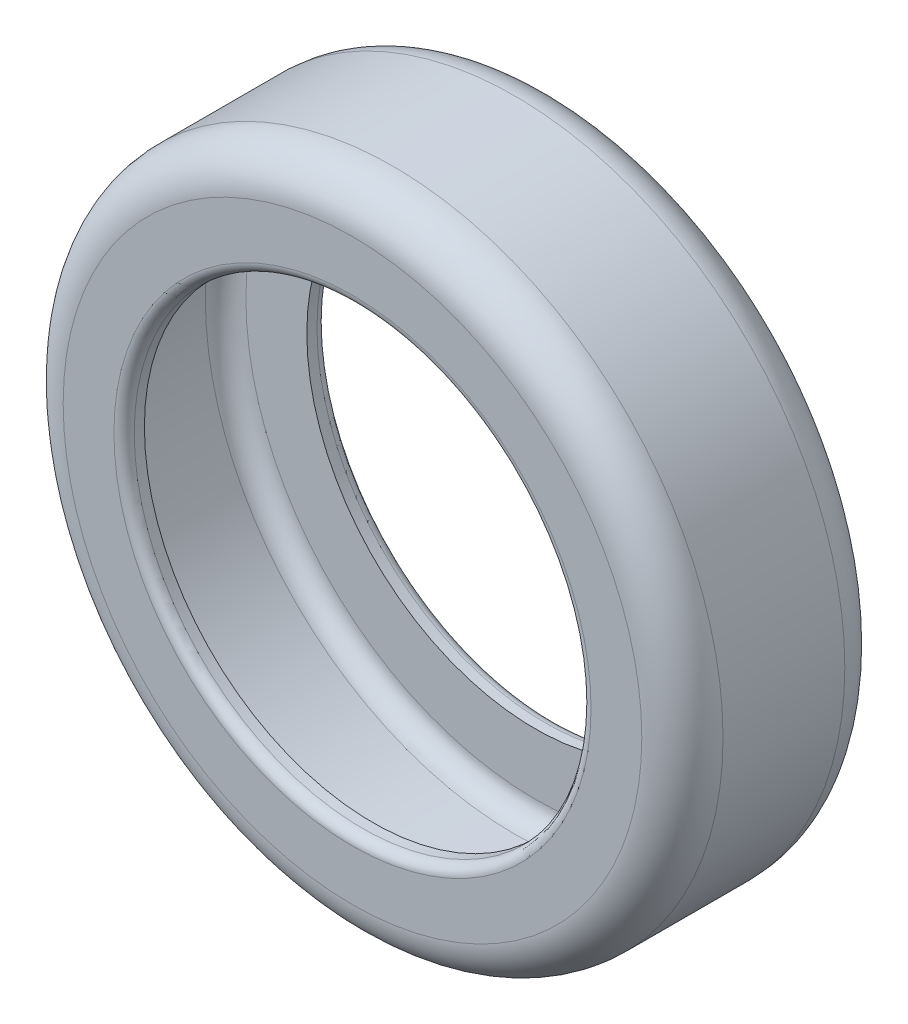
ISO-10303-21;
HEADER;
FILE_DESCRIPTION(('STEP AP214'),'2;1');
FILE_NAME('part.step','',(''),(''),'','','');
FILE_SCHEMA(('AUTOMOTIVE_DESIGN { 1 0 10303 214 1 1 1 1 }'));
ENDSEC;
DATA;
#1=APPLICATION_CONTEXT('core data for automotive mechanical design processes');
#2=APPLICATION_PROTOCOL_DEFINITION('international standard','automotive_design',2000,#1);
#3=PRODUCT_CONTEXT('',#1,'mechanical');
#4=PRODUCT('Part','Part','',(#3));
#5=PRODUCT_RELATED_PRODUCT_CATEGORY('part','',(#4));
#6=PRODUCT_DEFINITION_FORMATION('','',#4);
#7=PRODUCT_DEFINITION_CONTEXT('part definition',#1,'design');
#8=PRODUCT_DEFINITION('design','',#6,#7);
#9=PRODUCT_DEFINITION_SHAPE('','',#8);
#10=(LENGTH_UNIT() NAMED_UNIT(*) SI_UNIT(.MILLI.,.METRE.));
#11=(NAMED_UNIT(*) PLANE_ANGLE_UNIT() SI_UNIT($,.RADIAN.));
#12=(NAMED_UNIT(*) SI_UNIT($,.STERADIAN.) SOLID_ANGLE_UNIT());
#13=UNCERTAINTY_MEASURE_WITH_UNIT(LENGTH_MEASURE(1.E-05),#10,'distance_accuracy_value','');
#14=(GEOMETRIC_REPRESENTATION_CONTEXT(3) GLOBAL_UNCERTAINTY_ASSIGNED_CONTEXT((#13)) GLOBAL_UNIT_ASSIGNED_CONTEXT((#10,
#11,#12)) REPRESENTATION_CONTEXT('',''));
#15=CARTESIAN_POINT('',(0.,0.,0.));
#16=DIRECTION('',(0.,0.,1.));
#17=DIRECTION('',(1.,0.,0.));
#18=AXIS2_PLACEMENT_3D('',#15,#16,#17);
#19=CARTESIAN_POINT('',(0.,0.,20.));
#20=DIRECTION('',(0.,0.,-1.));
#21=DIRECTION('',(-1.,0.,0.));
#22=AXIS2_PLACEMENT_3D('',#19,#20,#21);
#23=CYLINDRICAL_SURFACE('',#22,22.5);
#24=CARTESIAN_POINT('',(0.,0.,19.));
#25=DIRECTION('',(0.,0.,1.));
#26=DIRECTION('',(1.,0.,0.));
#27=AXIS2_PLACEMENT_3D('',#24,#25,#26);
#28=CIRCLE('',#27,22.5);
#29=CARTESIAN_POINT('',(22.5,0.,19.));
#30=VERTEX_POINT('',#29);
#31=EDGE_CURVE('E125',#30,#30,#28,.T.);
#32=ORIENTED_EDGE('',*,*,#31,.T.);
#33=EDGE_LOOP('',(#32));
#34=FACE_BOUND('',#33,.T.);
#35=CARTESIAN_POINT('',(0.,0.,18.));
#36=DIRECTION('',(0.,0.,1.));
#37=DIRECTION('',(1.,0.,0.));
#38=AXIS2_PLACEMENT_3D('',#35,#36,#37);
#39=CIRCLE('',#38,22.5);
#40=CARTESIAN_POINT('',(22.5,0.,18.));
#41=VERTEX_POINT('',#40);
#42=EDGE_CURVE('E146',#41,#41,#39,.F.);
#43=ORIENTED_EDGE('',*,*,#42,.T.);
#44=EDGE_LOOP('',(#43));
#45=FACE_BOUND('',#44,.T.);
#46=ADVANCED_FACE('F114',(#34,#45),#23,.F.);
#47=CARTESIAN_POINT('',(0.,0.,20.));
#48=DIRECTION('',(0.,0.,1.));
#49=DIRECTION('',(1.,0.,0.));
#50=AXIS2_PLACEMENT_3D('',#47,#48,#49);
#51=PLANE('',#50);
#52=CARTESIAN_POINT('',(0.,0.,20.));
#53=DIRECTION('',(0.,0.,1.));
#54=DIRECTION('',(1.,0.,0.));
#55=AXIS2_PLACEMENT_3D('',#52,#53,#54);
#56=CIRCLE('',#55,23.5);
#57=CARTESIAN_POINT('',(23.5,0.,20.));
#58=VERTEX_POINT('',#57);
#59=EDGE_CURVE('E121',#58,#58,#56,.F.);
#60=ORIENTED_EDGE('',*,*,#59,.T.);
#61=EDGE_LOOP('',(#60));
#62=FACE_BOUND('',#61,.T.);
#63=CARTESIAN_POINT('',(0.,0.,20.));
#64=DIRECTION('',(0.,0.,1.));
#65=DIRECTION('',(1.,0.,0.));
#66=AXIS2_PLACEMENT_3D('',#63,#64,#65);
#67=CIRCLE('',#66,28.5);
#68=CARTESIAN_POINT('',(28.5,0.,20.));
#69=VERTEX_POINT('',#68);
#70=EDGE_CURVE('E134',#69,#69,#67,.T.);
#71=ORIENTED_EDGE('',*,*,#70,.T.);
#72=EDGE_LOOP('',(#71));
#73=FACE_BOUND('',#72,.T.);
#74=ADVANCED_FACE('F175',(#62,#73),#51,.T.);
#75=CARTESIAN_POINT('',(0.,0.,0.));
#76=DIRECTION('',(0.,0.,1.));
#77=DIRECTION('',(1.,0.,0.));
#78=AXIS2_PLACEMENT_3D('',#75,#76,#77);
#79=PLANE('',#78);
#80=CARTESIAN_POINT('',(0.,0.,0.));
#81=DIRECTION('',(0.,0.,1.));
#82=DIRECTION('',(1.,0.,0.));
#83=AXIS2_PLACEMENT_3D('',#80,#81,#82);
#84=CIRCLE('',#83,23.5);
#85=CARTESIAN_POINT('',(23.5,0.,0.));
#86=VERTEX_POINT('',#85);
#87=EDGE_CURVE('E11',#86,#86,#84,.T.);
#88=ORIENTED_EDGE('',*,*,#87,.T.);
#89=EDGE_LOOP('',(#88));
#90=FACE_BOUND('',#89,.T.);
#91=CARTESIAN_POINT('',(0.,0.,0.));
#92=DIRECTION('',(0.,0.,1.));
#93=DIRECTION('',(1.,0.,0.));
#94=AXIS2_PLACEMENT_3D('',#91,#92,#93);
#95=CIRCLE('',#94,28.5);
#96=CARTESIAN_POINT('',(28.5,0.,0.));
#97=VERTEX_POINT('',#96);
#98=EDGE_CURVE('E137',#97,#97,#95,.F.);
#99=ORIENTED_EDGE('',*,*,#98,.T.);
#100=EDGE_LOOP('',(#99));
#101=FACE_BOUND('',#100,.T.);
#102=ADVANCED_FACE('F182',(#90,#101),#79,.F.);
#103=CARTESIAN_POINT('',(0.,0.,20.));
#104=DIRECTION('',(0.,0.,-1.));
#105=DIRECTION('',(-1.,0.,0.));
#106=AXIS2_PLACEMENT_3D('',#103,#104,#105);
#107=CYLINDRICAL_SURFACE('',#106,32.5);
#108=CARTESIAN_POINT('',(0.,0.,4.));
#109=DIRECTION('',(0.,0.,1.));
#110=DIRECTION('',(1.,0.,0.));
#111=AXIS2_PLACEMENT_3D('',#108,#109,#110);
#112=CIRCLE('',#111,32.5);
#113=CARTESIAN_POINT('',(32.5,0.,4.));
#114=VERTEX_POINT('',#113);
#115=EDGE_CURVE('E140',#114,#114,#112,.T.);
#116=ORIENTED_EDGE('',*,*,#115,.T.);
#117=EDGE_LOOP('',(#116));
#118=FACE_BOUND('',#117,.T.);
#119=CARTESIAN_POINT('',(0.,0.,16.));
#120=DIRECTION('',(0.,0.,1.));
#121=DIRECTION('',(1.,0.,0.));
#122=AXIS2_PLACEMENT_3D('',#119,#120,#121);
#123=CIRCLE('',#122,32.5);
#124=CARTESIAN_POINT('',(32.5,0.,16.));
#125=VERTEX_POINT('',#124);
#126=EDGE_CURVE('E143',#125,#125,#123,.F.);
#127=ORIENTED_EDGE('',*,*,#126,.T.);
#128=EDGE_LOOP('',(#127));
#129=FACE_BOUND('',#128,.T.);
#130=ADVANCED_FACE('F187',(#118,#129),#107,.T.);
#131=CARTESIAN_POINT('',(0.,0.,2.));
#132=DIRECTION('',(0.,0.,1.));
#133=DIRECTION('',(1.,0.,0.));
#134=AXIS2_PLACEMENT_3D('',#131,#132,#133);
#135=CIRCLE('',#134,22.5);
#136=CARTESIAN_POINT('',(22.5,0.,2.));
#137=VERTEX_POINT('',#136);
#138=EDGE_CURVE('E147',#137,#137,#135,.F.);
#139=ORIENTED_EDGE('',*,*,#138,.F.);
#140=EDGE_LOOP('',(#139));
#141=FACE_BOUND('',#140,.T.);
#142=CARTESIAN_POINT('',(0.,0.,1.));
#143=DIRECTION('',(0.,0.,1.));
#144=DIRECTION('',(1.,0.,0.));
#145=AXIS2_PLACEMENT_3D('',#142,#143,#144);
#146=CIRCLE('',#145,22.5);
#147=CARTESIAN_POINT('',(22.5,0.,1.));
#148=VERTEX_POINT('',#147);
#149=EDGE_CURVE('E129',#148,#148,#146,.F.);
#150=ORIENTED_EDGE('',*,*,#149,.T.);
#151=EDGE_LOOP('',(#150));
#152=FACE_BOUND('',#151,.T.);
#153=ADVANCED_FACE('F178',(#141,#152),#23,.F.);
#154=CARTESIAN_POINT('',(0.,0.,4.));
#155=DIRECTION('',(0.,0.,1.));
#156=DIRECTION('',(1.,0.,0.));
#157=AXIS2_PLACEMENT_3D('',#154,#155,#156);
#158=TOROIDAL_SURFACE('',#157,28.5,4.);
#159=ORIENTED_EDGE('',*,*,#98,.F.);
#160=EDGE_LOOP('',(#159));
#161=FACE_BOUND('',#160,.T.);
#162=ORIENTED_EDGE('',*,*,#115,.F.);
#163=EDGE_LOOP('',(#162));
#164=FACE_BOUND('',#163,.T.);
#165=ADVANCED_FACE('F186',(#161,#164),#158,.T.);
#166=CARTESIAN_POINT('',(0.,0.,16.));
#167=DIRECTION('',(0.,0.,1.));
#168=DIRECTION('',(1.,0.,0.));
#169=AXIS2_PLACEMENT_3D('',#166,#167,#168);
#170=TOROIDAL_SURFACE('',#169,28.5,4.);
#171=ORIENTED_EDGE('',*,*,#126,.F.);
#172=EDGE_LOOP('',(#171));
#173=FACE_BOUND('',#172,.T.);
#174=ORIENTED_EDGE('',*,*,#70,.F.);
#175=EDGE_LOOP('',(#174));
#176=FACE_BOUND('',#175,.T.);
#177=ADVANCED_FACE('F193',(#173,#176),#170,.T.);
#178=CARTESIAN_POINT('',(0.,0.,19.));
#179=DIRECTION('',(0.,0.,1.));
#180=DIRECTION('',(1.,0.,0.));
#181=AXIS2_PLACEMENT_3D('',#178,#179,#180);
#182=TOROIDAL_SURFACE('',#181,23.5,1.);
#183=ORIENTED_EDGE('',*,*,#59,.F.);
#184=EDGE_LOOP('',(#183));
#185=FACE_BOUND('',#184,.T.);
#186=ORIENTED_EDGE('',*,*,#31,.F.);
#187=EDGE_LOOP('',(#186));
#188=FACE_BOUND('',#187,.T.);
#189=ADVANCED_FACE('F204',(#185,#188),#182,.T.);
#190=CARTESIAN_POINT('',(0.,0.,1.));
#191=DIRECTION('',(0.,0.,1.));
#192=DIRECTION('',(1.,0.,0.));
#193=AXIS2_PLACEMENT_3D('',#190,#191,#192);
#194=TOROIDAL_SURFACE('',#193,23.5,1.);
#195=ORIENTED_EDGE('',*,*,#149,.F.);
#196=EDGE_LOOP('',(#195));
#197=FACE_BOUND('',#196,.T.);
#198=ORIENTED_EDGE('',*,*,#87,.F.);
#199=EDGE_LOOP('',(#198));
#200=FACE_BOUND('',#199,.T.);
#201=ADVANCED_FACE('F116',(#197,#200),#194,.T.);
#202=CARTESIAN_POINT('',(0.,0.,18.));
#203=DIRECTION('',(0.,0.,1.));
#204=DIRECTION('',(1.,0.,0.));
#205=AXIS2_PLACEMENT_3D('',#202,#203,#204);
#206=PLANE('',#205);
#207=CARTESIAN_POINT('',(0.,0.,18.));
#208=DIRECTION('',(0.,0.,1.));
#209=DIRECTION('',(1.,0.,0.));
#210=AXIS2_PLACEMENT_3D('',#207,#208,#209);
#211=CIRCLE('',#210,28.5);
#212=CARTESIAN_POINT('',(28.5,0.,18.));
#213=VERTEX_POINT('',#212);
#214=EDGE_CURVE('E150',#213,#213,#211,.T.);
#215=ORIENTED_EDGE('',*,*,#214,.F.);
#216=EDGE_LOOP('',(#215));
#217=FACE_BOUND('',#216,.T.);
#218=ORIENTED_EDGE('',*,*,#42,.F.);
#219=EDGE_LOOP('',(#218));
#220=FACE_BOUND('',#219,.T.);
#221=ADVANCED_FACE('F167',(#217,#220),#206,.F.);
#222=CARTESIAN_POINT('',(0.,0.,2.));
#223=DIRECTION('',(0.,0.,1.));
#224=DIRECTION('',(1.,0.,0.));
#225=AXIS2_PLACEMENT_3D('',#222,#223,#224);
#226=PLANE('',#225);
#227=CARTESIAN_POINT('',(0.,0.,2.));
#228=DIRECTION('',(0.,0.,1.));
#229=DIRECTION('',(1.,0.,0.));
#230=AXIS2_PLACEMENT_3D('',#227,#228,#229);
#231=CIRCLE('',#230,28.5);
#232=CARTESIAN_POINT('',(28.5,0.,2.));
#233=VERTEX_POINT('',#232);
#234=EDGE_CURVE('E153',#233,#233,#231,.F.);
#235=ORIENTED_EDGE('',*,*,#234,.F.);
#236=EDGE_LOOP('',(#235));
#237=FACE_BOUND('',#236,.T.);
#238=ORIENTED_EDGE('',*,*,#138,.T.);
#239=EDGE_LOOP('',(#238));
#240=FACE_BOUND('',#239,.T.);
#241=ADVANCED_FACE('F170',(#237,#240),#226,.T.);
#242=CARTESIAN_POINT('',(0.,0.,20.));
#243=DIRECTION('',(0.,0.,-1.));
#244=DIRECTION('',(-1.,0.,0.));
#245=AXIS2_PLACEMENT_3D('',#242,#243,#244);
#246=CYLINDRICAL_SURFACE('',#245,30.5);
#247=CARTESIAN_POINT('',(0.,0.,4.));
#248=DIRECTION('',(0.,0.,-1.));
#249=DIRECTION('',(-1.,0.,0.));
#250=AXIS2_PLACEMENT_3D('',#247,#248,#249);
#251=CIRCLE('',#250,30.5);
#252=CARTESIAN_POINT('',(-30.5,0.,4.));
#253=VERTEX_POINT('',#252);
#254=EDGE_CURVE('E156',#253,#253,#251,.F.);
#255=ORIENTED_EDGE('',*,*,#254,.F.);
#256=EDGE_LOOP('',(#255));
#257=FACE_BOUND('',#256,.T.);
#258=CARTESIAN_POINT('',(0.,0.,16.));
#259=DIRECTION('',(0.,0.,-1.));
#260=DIRECTION('',(-1.,0.,0.));
#261=AXIS2_PLACEMENT_3D('',#258,#259,#260);
#262=CIRCLE('',#261,30.5);
#263=CARTESIAN_POINT('',(-30.5,0.,16.));
#264=VERTEX_POINT('',#263);
#265=EDGE_CURVE('E159',#264,#264,#262,.T.);
#266=ORIENTED_EDGE('',*,*,#265,.F.);
#267=EDGE_LOOP('',(#266));
#268=FACE_BOUND('',#267,.T.);
#269=ADVANCED_FACE('F280',(#257,#268),#246,.F.);
#270=CARTESIAN_POINT('',(0.,0.,4.));
#271=DIRECTION('',(0.,0.,1.));
#272=DIRECTION('',(1.,0.,0.));
#273=AXIS2_PLACEMENT_3D('',#270,#271,#272);
#274=TOROIDAL_SURFACE('',#273,28.5,2.);
#275=ORIENTED_EDGE('',*,*,#234,.T.);
#276=EDGE_LOOP('',(#275));
#277=FACE_BOUND('',#276,.T.);
#278=ORIENTED_EDGE('',*,*,#254,.T.);
#279=EDGE_LOOP('',(#278));
#280=FACE_BOUND('',#279,.T.);
#281=ADVANCED_FACE('F289',(#277,#280),#274,.F.);
#282=CARTESIAN_POINT('',(0.,0.,16.));
#283=DIRECTION('',(0.,0.,1.));
#284=DIRECTION('',(1.,0.,0.));
#285=AXIS2_PLACEMENT_3D('',#282,#283,#284);
#286=TOROIDAL_SURFACE('',#285,28.5,2.);
#287=ORIENTED_EDGE('',*,*,#265,.T.);
#288=EDGE_LOOP('',(#287));
#289=FACE_BOUND('',#288,.T.);
#290=ORIENTED_EDGE('',*,*,#214,.T.);
#291=EDGE_LOOP('',(#290));
#292=FACE_BOUND('',#291,.T.);
#293=ADVANCED_FACE('F165',(#289,#292),#286,.F.);
#294=CLOSED_SHELL('',(#46,#74,#102,#130,#153,#165,#177,#189,#201,#221,#241,#269,#281,#293));
#295=MANIFOLD_SOLID_BREP('B2',#294);
#296=ADVANCED_BREP_SHAPE_REPRESENTATION('',(#18,#295),#14);
#297=SHAPE_DEFINITION_REPRESENTATION(#9,#296);
ENDSEC;
END-ISO-10303-21;
